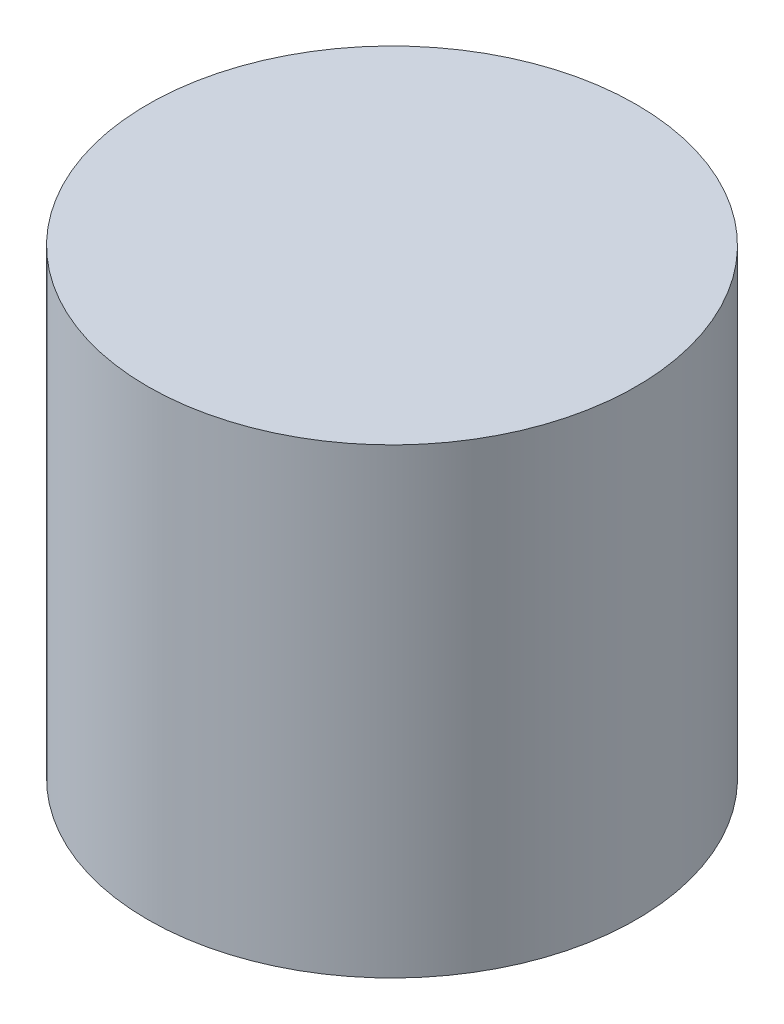
ISO-10303-21;
HEADER;
FILE_DESCRIPTION(('STEP AP214'),'2;1');
FILE_NAME('part.step','',(''),(''),'','','');
FILE_SCHEMA(('AUTOMOTIVE_DESIGN { 1 0 10303 214 1 1 1 1 }'));
ENDSEC;
DATA;
#1=APPLICATION_CONTEXT('core data for automotive mechanical design processes');
#2=APPLICATION_PROTOCOL_DEFINITION('international standard','automotive_design',2000,#1);
#3=PRODUCT_CONTEXT('',#1,'mechanical');
#4=PRODUCT('Part','Part','',(#3));
#5=PRODUCT_RELATED_PRODUCT_CATEGORY('part','',(#4));
#6=PRODUCT_DEFINITION_FORMATION('','',#4);
#7=PRODUCT_DEFINITION_CONTEXT('part definition',#1,'design');
#8=PRODUCT_DEFINITION('design','',#6,#7);
#9=PRODUCT_DEFINITION_SHAPE('','',#8);
#10=(LENGTH_UNIT() NAMED_UNIT(*) SI_UNIT(.MILLI.,.METRE.));
#11=(NAMED_UNIT(*) PLANE_ANGLE_UNIT() SI_UNIT($,.RADIAN.));
#12=(NAMED_UNIT(*) SI_UNIT($,.STERADIAN.) SOLID_ANGLE_UNIT());
#13=UNCERTAINTY_MEASURE_WITH_UNIT(LENGTH_MEASURE(1.E-05),#10,'distance_accuracy_value','');
#14=(GEOMETRIC_REPRESENTATION_CONTEXT(3) GLOBAL_UNCERTAINTY_ASSIGNED_CONTEXT((#13)) GLOBAL_UNIT_ASSIGNED_CONTEXT((#10,
#11,#12)) REPRESENTATION_CONTEXT('',''));
#15=CARTESIAN_POINT('',(0.,0.,0.));
#16=DIRECTION('',(0.,0.,1.));
#17=DIRECTION('',(1.,0.,0.));
#18=AXIS2_PLACEMENT_3D('',#15,#16,#17);
#19=CARTESIAN_POINT('',(0.,30.,0.));
#20=DIRECTION('',(0.,-1.,0.));
#21=DIRECTION('',(0.,0.,-1.));
#22=AXIS2_PLACEMENT_3D('',#19,#20,#21);
#23=CYLINDRICAL_SURFACE('',#22,15.875);
#24=CARTESIAN_POINT('',(0.,30.,0.));
#25=DIRECTION('',(0.,1.,0.));
#26=DIRECTION('',(0.,0.,1.));
#27=AXIS2_PLACEMENT_3D('',#24,#25,#26);
#28=CIRCLE('',#27,15.875);
#29=CARTESIAN_POINT('',(0.,30.,15.875));
#30=VERTEX_POINT('',#29);
#31=EDGE_CURVE('E10',#30,#30,#28,.T.);
#32=ORIENTED_EDGE('',*,*,#31,.F.);
#33=EDGE_LOOP('',(#32));
#34=FACE_BOUND('',#33,.T.);
#35=CARTESIAN_POINT('',(0.,0.,0.));
#36=DIRECTION('',(0.,1.,0.));
#37=DIRECTION('',(0.,0.,1.));
#38=AXIS2_PLACEMENT_3D('',#35,#36,#37);
#39=CIRCLE('',#38,15.875);
#40=CARTESIAN_POINT('',(0.,0.,15.875));
#41=VERTEX_POINT('',#40);
#42=EDGE_CURVE('E35',#41,#41,#39,.T.);
#43=ORIENTED_EDGE('',*,*,#42,.T.);
#44=EDGE_LOOP('',(#43));
#45=FACE_BOUND('',#44,.T.);
#46=ADVANCED_FACE('F32',(#34,#45),#23,.T.);
#47=CARTESIAN_POINT('',(0.,30.,0.));
#48=DIRECTION('',(0.,1.,0.));
#49=DIRECTION('',(0.,0.,1.));
#50=AXIS2_PLACEMENT_3D('',#47,#48,#49);
#51=PLANE('',#50);
#52=ORIENTED_EDGE('',*,*,#31,.T.);
#53=EDGE_LOOP('',(#52));
#54=FACE_BOUND('',#53,.T.);
#55=ADVANCED_FACE('F47',(#54),#51,.T.);
#56=CARTESIAN_POINT('',(0.,0.,0.));
#57=DIRECTION('',(0.,1.,0.));
#58=DIRECTION('',(0.,0.,1.));
#59=AXIS2_PLACEMENT_3D('',#56,#57,#58);
#60=PLANE('',#59);
#61=ORIENTED_EDGE('',*,*,#42,.F.);
#62=EDGE_LOOP('',(#61));
#63=FACE_BOUND('',#62,.T.);
#64=ADVANCED_FACE('F45',(#63),#60,.F.);
#65=CLOSED_SHELL('',(#46,#55,#64));
#66=MANIFOLD_SOLID_BREP('B2',#65);
#67=ADVANCED_BREP_SHAPE_REPRESENTATION('',(#18,#66),#14);
#68=SHAPE_DEFINITION_REPRESENTATION(#9,#67);
ENDSEC;
END-ISO-10303-21;
